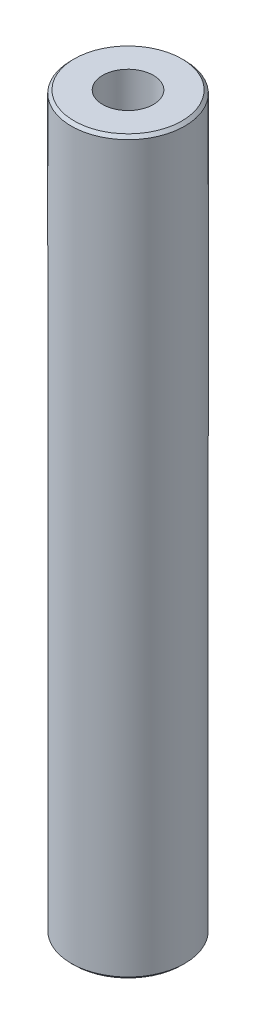
ISO-10303-21;
HEADER;
FILE_DESCRIPTION(('STEP AP214'),'2;1');
FILE_NAME('part.step','',(''),(''),'','','');
FILE_SCHEMA(('AUTOMOTIVE_DESIGN { 1 0 10303 214 1 1 1 1 }'));
ENDSEC;
DATA;
#1=APPLICATION_CONTEXT('core data for automotive mechanical design processes');
#2=APPLICATION_PROTOCOL_DEFINITION('international standard','automotive_design',2000,#1);
#3=PRODUCT_CONTEXT('',#1,'mechanical');
#4=PRODUCT('Part','Part','',(#3));
#5=PRODUCT_RELATED_PRODUCT_CATEGORY('part','',(#4));
#6=PRODUCT_DEFINITION_FORMATION('','',#4);
#7=PRODUCT_DEFINITION_CONTEXT('part definition',#1,'design');
#8=PRODUCT_DEFINITION('design','',#6,#7);
#9=PRODUCT_DEFINITION_SHAPE('','',#8);
#10=(LENGTH_UNIT() NAMED_UNIT(*) SI_UNIT(.MILLI.,.METRE.));
#11=(NAMED_UNIT(*) PLANE_ANGLE_UNIT() SI_UNIT($,.RADIAN.));
#12=(NAMED_UNIT(*) SI_UNIT($,.STERADIAN.) SOLID_ANGLE_UNIT());
#13=UNCERTAINTY_MEASURE_WITH_UNIT(LENGTH_MEASURE(1.E-05),#10,'distance_accuracy_value','');
#14=(GEOMETRIC_REPRESENTATION_CONTEXT(3) GLOBAL_UNCERTAINTY_ASSIGNED_CONTEXT((#13)) GLOBAL_UNIT_ASSIGNED_CONTEXT((#10,
#11,#12)) REPRESENTATION_CONTEXT('',''));
#15=CARTESIAN_POINT('',(0.,0.,0.));
#16=DIRECTION('',(0.,0.,1.));
#17=DIRECTION('',(1.,0.,0.));
#18=AXIS2_PLACEMENT_3D('',#15,#16,#17);
#19=CARTESIAN_POINT('',(0.,225.261387444064,0.));
#20=DIRECTION('',(0.,-1.,0.));
#21=DIRECTION('',(0.,0.,-1.));
#22=AXIS2_PLACEMENT_3D('',#19,#20,#21);
#23=CYLINDRICAL_SURFACE('',#22,17.5);
#24=CARTESIAN_POINT('',(0.,224.34722172086,0.));
#25=DIRECTION('',(0.,1.,0.));
#26=DIRECTION('',(0.,0.,1.));
#27=AXIS2_PLACEMENT_3D('',#24,#25,#26);
#28=CIRCLE('',#27,17.5);
#29=CARTESIAN_POINT('',(0.,224.34722172086,-17.5));
#30=VERTEX_POINT('',#29);
#31=EDGE_CURVE('E50',#30,#30,#28,.F.);
#32=CARTESIAN_POINT('',(0.,0.914165723204352,0.));
#33=DIRECTION('',(0.,1.,0.));
#34=DIRECTION('',(0.,0.,1.));
#35=AXIS2_PLACEMENT_3D('',#32,#33,#34);
#36=CIRCLE('',#35,17.5);
#37=CARTESIAN_POINT('',(0.,0.914165723204352,-17.5));
#38=VERTEX_POINT('',#37);
#39=EDGE_CURVE('E51',#38,#38,#36,.T.);
#40=CARTESIAN_POINT('',(0.,224.34722172086,-17.5));
#41=CARTESIAN_POINT('',(0.,222.019794054218,-17.5));
#42=CARTESIAN_POINT('',(0.,219.692366387575,-17.5));
#43=CARTESIAN_POINT('',(0.,215.037511054291,-17.5));
#44=CARTESIAN_POINT('',(0.,212.710083387649,-17.5));
#45=CARTESIAN_POINT('',(0.,208.055228054364,-17.5));
#46=CARTESIAN_POINT('',(0.,205.727800387722,-17.5));
#47=CARTESIAN_POINT('',(0.,201.072945054437,-17.5));
#48=CARTESIAN_POINT('',(0.,198.745517387795,-17.5));
#49=CARTESIAN_POINT('',(0.,194.090662054511,-17.5));
#50=CARTESIAN_POINT('',(0.,191.763234387868,-17.5));
#51=CARTESIAN_POINT('',(0.,187.108379054584,-17.5));
#52=CARTESIAN_POINT('',(0.,184.780951387942,-17.5));
#53=CARTESIAN_POINT('',(0.,180.126096054657,-17.5));
#54=CARTESIAN_POINT('',(0.,177.798668388015,-17.5));
#55=CARTESIAN_POINT('',(0.,173.14381305473,-17.5));
#56=CARTESIAN_POINT('',(0.,170.816385388088,-17.5));
#57=CARTESIAN_POINT('',(0.,166.161530054804,-17.5));
#58=CARTESIAN_POINT('',(0.,163.834102388161,-17.5));
#59=CARTESIAN_POINT('',(0.,159.179247054877,-17.5));
#60=CARTESIAN_POINT('',(0.,156.851819388235,-17.5));
#61=CARTESIAN_POINT('',(0.,152.19696405495,-17.5));
#62=CARTESIAN_POINT('',(0.,149.869536388308,-17.5));
#63=CARTESIAN_POINT('',(0.,145.214681055024,-17.5));
#64=CARTESIAN_POINT('',(0.,142.887253388381,-17.5));
#65=CARTESIAN_POINT('',(0.,138.232398055097,-17.5));
#66=CARTESIAN_POINT('',(0.,135.904970388455,-17.5));
#67=CARTESIAN_POINT('',(0.,131.25011505517,-17.5));
#68=CARTESIAN_POINT('',(0.,128.922687388528,-17.5));
#69=CARTESIAN_POINT('',(0.,124.267832055243,-17.5));
#70=CARTESIAN_POINT('',(0.,121.940404388601,-17.5));
#71=CARTESIAN_POINT('',(0.,117.285549055317,-17.5));
#72=CARTESIAN_POINT('',(0.,114.958121388674,-17.5));
#73=CARTESIAN_POINT('',(0.,110.30326605539,-17.5));
#74=CARTESIAN_POINT('',(0.,107.975838388748,-17.5));
#75=CARTESIAN_POINT('',(0.,103.320983055463,-17.5));
#76=CARTESIAN_POINT('',(0.,100.993555388821,-17.5));
#77=CARTESIAN_POINT('',(0.,96.3387000555364,-17.5));
#78=CARTESIAN_POINT('',(0.,94.0112723888942,-17.5));
#79=CARTESIAN_POINT('',(0.,89.3564170556097,-17.5));
#80=CARTESIAN_POINT('',(0.,87.0289893889674,-17.5));
#81=CARTESIAN_POINT('',(0.,82.3741340556829,-17.5));
#82=CARTESIAN_POINT('',(0.,80.0467063890407,-17.5));
#83=CARTESIAN_POINT('',(0.,75.3918510557562,-17.5));
#84=CARTESIAN_POINT('',(0.,73.0644233891139,-17.5));
#85=CARTESIAN_POINT('',(0.,68.4095680558294,-17.5));
#86=CARTESIAN_POINT('',(0.,66.0821403891872,-17.5));
#87=CARTESIAN_POINT('',(0.,61.4272850559027,-17.5));
#88=CARTESIAN_POINT('',(0.,59.0998573892605,-17.5));
#89=CARTESIAN_POINT('',(0.,54.445002055976,-17.5));
#90=CARTESIAN_POINT('',(0.,52.1175743893337,-17.5));
#91=CARTESIAN_POINT('',(0.,47.4627190560493,-17.5));
#92=CARTESIAN_POINT('',(0.,45.135291389407,-17.5));
#93=CARTESIAN_POINT('',(0.,40.4804360561225,-17.5));
#94=CARTESIAN_POINT('',(0.,38.1530083894803,-17.5));
#95=CARTESIAN_POINT('',(0.,33.4981530561958,-17.5));
#96=CARTESIAN_POINT('',(0.,31.1707253895535,-17.5));
#97=CARTESIAN_POINT('',(0.,26.515870056269,-17.5));
#98=CARTESIAN_POINT('',(0.,24.1884423896268,-17.5));
#99=CARTESIAN_POINT('',(0.,19.5335870563423,-17.5));
#100=CARTESIAN_POINT('',(0.,17.2061593897001,-17.5));
#101=CARTESIAN_POINT('',(0.,12.5513040564156,-17.5));
#102=CARTESIAN_POINT('',(0.,10.2238763897733,-17.5));
#103=CARTESIAN_POINT('',(0.,5.56902105648884,-17.5));
#104=CARTESIAN_POINT('',(0.,3.2415933898466,-17.5));
#105=CARTESIAN_POINT('',(0.,0.914165723204352,-17.5));
#106=B_SPLINE_CURVE_WITH_KNOTS('',3,(#40,#41,#42,#43,#44,#45,#46,#47,#48,#49,#50,#51,#52,#53,
#54,#55,#56,#57,#58,#59,#60,#61,#62,#63,#64,#65,#66,#67,#68,#69,#70,#71,#72,#73,#74,#75,#76,#77,
#78,#79,#80,#81,#82,#83,#84,#85,#86,#87,#88,#89,#90,#91,#92,#93,#94,#95,#96,#97,#98,#99,#100,
#101,#102,#103,#104,#105),.UNSPECIFIED.,.F.,.F.,(4,2,2,2,2,2,2,2,2,2,2,2,2,2,2,2,2,2,2,2,2,2,2,
2,2,2,2,2,2,2,2,2,4),(0.,6.98228299992673,13.9645659998535,20.9468489997802,27.9291319997069,
34.9114149996337,41.8936979995604,48.8759809994871,55.8582639994139,62.8405469993406,
69.8228299992673,76.805112999194,83.7873959991208,90.7696789990475,97.7519619989743,
104.734244998901,111.716527998828,118.698810998754,125.681093998681,132.663376998608,
139.645659998535,146.627942998461,153.610225998388,160.592508998315,167.574791998242,
174.557074998168,181.539357998095,188.521640998022,195.503923997949,202.486206997875,
209.468489997802,216.450772997729,223.433055997655),.UNSPECIFIED.);
#107=EDGE_CURVE('BSEAM39',#30,#38,#106,.T.);
#108=ORIENTED_EDGE('',*,*,#31,.T.);
#109=ORIENTED_EDGE('',*,*,#39,.T.);
#110=ORIENTED_EDGE('',*,*,#107,.T.);
#111=ORIENTED_EDGE('',*,*,#107,.F.);
#112=EDGE_LOOP('',(#108,#110,#109,#111));
#113=FACE_BOUND('',#112,.T.);
#114=ADVANCED_FACE('F39',(#113),#23,.T.);
#115=CARTESIAN_POINT('',(0.,225.261387444064,0.));
#116=DIRECTION('',(0.,1.,0.));
#117=DIRECTION('',(0.,0.,1.));
#118=AXIS2_PLACEMENT_3D('',#115,#116,#117);
#119=PLANE('',#118);
#120=CARTESIAN_POINT('',(0.,225.261387444064,0.));
#121=DIRECTION('',(0.,1.,0.));
#122=DIRECTION('',(0.,0.,1.));
#123=AXIS2_PLACEMENT_3D('',#120,#121,#122);
#124=CIRCLE('',#123,16.5858342767959);
#125=CARTESIAN_POINT('',(0.,225.261387444064,-16.5858342767959));
#126=VERTEX_POINT('',#125);
#127=EDGE_CURVE('E54',#126,#126,#124,.T.);
#128=ORIENTED_EDGE('',*,*,#127,.T.);
#129=EDGE_LOOP('',(#128));
#130=FACE_BOUND('',#129,.T.);
#131=CARTESIAN_POINT('',(0.,225.261387444064,0.));
#132=DIRECTION('',(0.,1.,0.));
#133=DIRECTION('',(0.,0.,1.));
#134=AXIS2_PLACEMENT_3D('',#131,#132,#133);
#135=CIRCLE('',#134,7.81030268506756);
#136=CARTESIAN_POINT('',(0.,225.261387444064,-7.81030268506756));
#137=VERTEX_POINT('',#136);
#138=EDGE_CURVE('E58',#137,#137,#135,.T.);
#139=ORIENTED_EDGE('',*,*,#138,.F.);
#140=EDGE_LOOP('',(#139));
#141=FACE_BOUND('',#140,.T.);
#142=ADVANCED_FACE('F69',(#130,#141),#119,.T.);
#143=CARTESIAN_POINT('',(0.,0.,0.));
#144=DIRECTION('',(0.,1.,0.));
#145=DIRECTION('',(0.,0.,1.));
#146=AXIS2_PLACEMENT_3D('',#143,#144,#145);
#147=PLANE('',#146);
#148=CARTESIAN_POINT('',(0.,0.,0.));
#149=DIRECTION('',(0.,1.,0.));
#150=DIRECTION('',(0.,0.,1.));
#151=AXIS2_PLACEMENT_3D('',#148,#149,#150);
#152=CIRCLE('',#151,16.5858342767957);
#153=CARTESIAN_POINT('',(0.,0.,16.5858342767957));
#154=VERTEX_POINT('',#153);
#155=EDGE_CURVE('E10',#154,#154,#152,.F.);
#156=ORIENTED_EDGE('',*,*,#155,.T.);
#157=EDGE_LOOP('',(#156));
#158=FACE_BOUND('',#157,.T.);
#159=CARTESIAN_POINT('',(0.,0.,0.));
#160=DIRECTION('',(0.,1.,0.));
#161=DIRECTION('',(0.,0.,1.));
#162=AXIS2_PLACEMENT_3D('',#159,#160,#161);
#163=CIRCLE('',#162,7.81030268506756);
#164=CARTESIAN_POINT('',(0.,0.,-7.81030268506756));
#165=VERTEX_POINT('',#164);
#166=EDGE_CURVE('E63',#165,#165,#163,.T.);
#167=ORIENTED_EDGE('',*,*,#166,.T.);
#168=EDGE_LOOP('',(#167));
#169=FACE_BOUND('',#168,.T.);
#170=ADVANCED_FACE('F75',(#158,#169),#147,.F.);
#171=CARTESIAN_POINT('',(0.,225.261387444064,0.));
#172=DIRECTION('',(0.,-1.,0.));
#173=DIRECTION('',(0.,0.,-1.));
#174=AXIS2_PLACEMENT_3D('',#171,#172,#173);
#175=CYLINDRICAL_SURFACE('',#174,7.81030268506756);
#176=CARTESIAN_POINT('',(0.,225.261387444064,-7.81030268506756));
#177=CARTESIAN_POINT('',(0.,222.914914658188,-7.81030268506756));
#178=CARTESIAN_POINT('',(0.,220.568441872313,-7.81030268506756));
#179=CARTESIAN_POINT('',(0.,215.875496300561,-7.81030268506756));
#180=CARTESIAN_POINT('',(0.,213.529023514686,-7.81030268506756));
#181=CARTESIAN_POINT('',(0.,208.836077942934,-7.81030268506756));
#182=CARTESIAN_POINT('',(0.,206.489605157059,-7.81030268506756));
#183=CARTESIAN_POINT('',(0.,201.796659585307,-7.81030268506756));
#184=CARTESIAN_POINT('',(0.,199.450186799432,-7.81030268506756));
#185=CARTESIAN_POINT('',(0.,194.75724122768,-7.81030268506756));
#186=CARTESIAN_POINT('',(0.,192.410768441805,-7.81030268506756));
#187=CARTESIAN_POINT('',(0.,187.717822870053,-7.81030268506756));
#188=CARTESIAN_POINT('',(0.,185.371350084178,-7.81030268506756));
#189=CARTESIAN_POINT('',(0.,180.678404512426,-7.81030268506756));
#190=CARTESIAN_POINT('',(0.,178.331931726551,-7.81030268506756));
#191=CARTESIAN_POINT('',(0.,173.638986154799,-7.81030268506756));
#192=CARTESIAN_POINT('',(0.,171.292513368924,-7.81030268506756));
#193=CARTESIAN_POINT('',(0.,166.599567797172,-7.81030268506756));
#194=CARTESIAN_POINT('',(0.,164.253095011297,-7.81030268506756));
#195=CARTESIAN_POINT('',(0.,159.560149439545,-7.81030268506756));
#196=CARTESIAN_POINT('',(0.,157.21367665367,-7.81030268506756));
#197=CARTESIAN_POINT('',(0.,152.520731081918,-7.81030268506756));
#198=CARTESIAN_POINT('',(0.,150.174258296043,-7.81030268506756));
#199=CARTESIAN_POINT('',(0.,145.481312724291,-7.81030268506756));
#200=CARTESIAN_POINT('',(0.,143.134839938416,-7.81030268506756));
#201=CARTESIAN_POINT('',(0.,138.441894366664,-7.81030268506756));
#202=CARTESIAN_POINT('',(0.,136.095421580789,-7.81030268506756));
#203=CARTESIAN_POINT('',(0.,131.402476009037,-7.81030268506756));
#204=CARTESIAN_POINT('',(0.,129.056003223162,-7.81030268506756));
#205=CARTESIAN_POINT('',(0.,124.36305765141,-7.81030268506756));
#206=CARTESIAN_POINT('',(0.,122.016584865535,-7.81030268506756));
#207=CARTESIAN_POINT('',(0.,117.323639293783,-7.81030268506756));
#208=CARTESIAN_POINT('',(0.,114.977166507908,-7.81030268506756));
#209=CARTESIAN_POINT('',(0.,110.284220936156,-7.81030268506756));
#210=CARTESIAN_POINT('',(0.,107.937748150281,-7.81030268506756));
#211=CARTESIAN_POINT('',(0.,103.244802578529,-7.81030268506756));
#212=CARTESIAN_POINT('',(0.,100.898329792654,-7.81030268506756));
#213=CARTESIAN_POINT('',(0.,96.2053842209023,-7.81030268506756));
#214=CARTESIAN_POINT('',(0.,93.8589114350267,-7.81030268506756));
#215=CARTESIAN_POINT('',(0.,89.1659658632753,-7.81030268506756));
#216=CARTESIAN_POINT('',(0.,86.8194930773997,-7.81030268506756));
#217=CARTESIAN_POINT('',(0.,82.1265475056483,-7.81030268506756));
#218=CARTESIAN_POINT('',(0.,79.7800747197727,-7.81030268506756));
#219=CARTESIAN_POINT('',(0.,75.0871291480213,-7.81030268506756));
#220=CARTESIAN_POINT('',(0.,72.7406563621456,-7.81030268506756));
#221=CARTESIAN_POINT('',(0.,68.0477107903943,-7.81030268506756));
#222=CARTESIAN_POINT('',(0.,65.7012380045187,-7.81030268506756));
#223=CARTESIAN_POINT('',(0.,61.0082924327673,-7.81030268506756));
#224=CARTESIAN_POINT('',(0.,58.6618196468917,-7.81030268506756));
#225=CARTESIAN_POINT('',(0.,53.9688740751403,-7.81030268506756));
#226=CARTESIAN_POINT('',(0.,51.6224012892647,-7.81030268506756));
#227=CARTESIAN_POINT('',(0.,46.9294557175133,-7.81030268506756));
#228=CARTESIAN_POINT('',(0.,44.5829829316377,-7.81030268506756));
#229=CARTESIAN_POINT('',(0.,39.8900373598863,-7.81030268506756));
#230=CARTESIAN_POINT('',(0.,37.5435645740107,-7.81030268506756));
#231=CARTESIAN_POINT('',(0.,32.8506190022593,-7.81030268506756));
#232=CARTESIAN_POINT('',(0.,30.5041462163837,-7.81030268506756));
#233=CARTESIAN_POINT('',(0.,25.8112006446323,-7.81030268506756));
#234=CARTESIAN_POINT('',(0.,23.4647278587567,-7.81030268506756));
#235=CARTESIAN_POINT('',(0.,18.7717822870053,-7.81030268506756));
#236=CARTESIAN_POINT('',(0.,16.4253095011297,-7.81030268506756));
#237=CARTESIAN_POINT('',(0.,11.7323639293783,-7.81030268506756));
#238=CARTESIAN_POINT('',(0.,9.38589114350267,-7.81030268506756));
#239=CARTESIAN_POINT('',(0.,4.69294557175133,-7.81030268506756));
#240=CARTESIAN_POINT('',(0.,2.34647278587566,-7.81030268506756));
#241=CARTESIAN_POINT('',(0.,0.,-7.81030268506756));
#242=B_SPLINE_CURVE_WITH_KNOTS('',3,(#176,#177,#178,#179,#180,#181,#182,#183,#184,#185,#186,
#187,#188,#189,#190,#191,#192,#193,#194,#195,#196,#197,#198,#199,#200,#201,#202,#203,#204,#205,
#206,#207,#208,#209,#210,#211,#212,#213,#214,#215,#216,#217,#218,#219,#220,#221,#222,#223,#224,
#225,#226,#227,#228,#229,#230,#231,#232,#233,#234,#235,#236,#237,#238,#239,#240,#241),
.UNSPECIFIED.,.F.,.F.,(4,2,2,2,2,2,2,2,2,2,2,2,2,2,2,2,2,2,2,2,2,2,2,2,2,2,2,2,2,2,2,2,4),(0.,
7.03941835762698,14.078836715254,21.118255072881,28.157673430508,35.197091788135,
42.236510145762,49.275928503389,56.315346861016,63.354765218643,70.39418357627,77.433601933897,
84.473020291524,91.512438649151,98.551857006778,105.591275364405,112.630693722032,
119.670112079659,126.709530437286,133.748948794913,140.78836715254,147.827785510167,
154.867203867794,161.906622225421,168.946040583048,175.985458940675,183.024877298302,
190.064295655929,197.103714013556,204.143132371183,211.18255072881,218.221969086437,
225.261387444064),.UNSPECIFIED.);
#243=EDGE_CURVE('BSEAM70',#137,#165,#242,.T.);
#244=ORIENTED_EDGE('',*,*,#138,.T.);
#245=ORIENTED_EDGE('',*,*,#166,.F.);
#246=ORIENTED_EDGE('',*,*,#243,.T.);
#247=ORIENTED_EDGE('',*,*,#243,.F.);
#248=EDGE_LOOP('',(#244,#246,#245,#247));
#249=FACE_BOUND('',#248,.T.);
#250=ADVANCED_FACE('F70',(#249),#175,.F.);
#251=CARTESIAN_POINT('',(0.,225.261387444064,0.));
#252=DIRECTION('',(0.,-1.,0.));
#253=DIRECTION('',(0.,0.,-1.));
#254=AXIS2_PLACEMENT_3D('',#251,#252,#253);
#255=CONICAL_SURFACE('',#254,16.5858342767959,0.785398163397475);
#256=CARTESIAN_POINT('',(0.,224.34722172086,-17.5));
#257=CARTESIAN_POINT('',(0.,224.356744280477,-17.4904774403833));
#258=CARTESIAN_POINT('',(0.,224.366266840093,-17.4809548807666));
#259=CARTESIAN_POINT('',(0.,224.385311959327,-17.4619097615332));
#260=CARTESIAN_POINT('',(0.,224.394834518943,-17.4523872019165));
#261=CARTESIAN_POINT('',(0.,224.413879638177,-17.433342082683));
#262=CARTESIAN_POINT('',(0.,224.423402197794,-17.4238195230663));
#263=CARTESIAN_POINT('',(0.,224.442447317027,-17.4047744038329));
#264=CARTESIAN_POINT('',(0.,224.451969876644,-17.3952518442162));
#265=CARTESIAN_POINT('',(0.,224.471014995877,-17.3762067249828));
#266=CARTESIAN_POINT('',(0.,224.480537555494,-17.3666841653661));
#267=CARTESIAN_POINT('',(0.,224.499582674727,-17.3476390461327));
#268=CARTESIAN_POINT('',(0.,224.509105234344,-17.338116486516));
#269=CARTESIAN_POINT('',(0.,224.528150353577,-17.3190713672825));
#270=CARTESIAN_POINT('',(0.,224.537672913194,-17.3095488076658));
#271=CARTESIAN_POINT('',(0.,224.556718032427,-17.2905036884324));
#272=CARTESIAN_POINT('',(0.,224.566240592044,-17.2809811288157));
#273=CARTESIAN_POINT('',(0.,224.585285711278,-17.2619360095823));
#274=CARTESIAN_POINT('',(0.,224.594808270894,-17.2524134499656));
#275=CARTESIAN_POINT('',(0.,224.613853390128,-17.2333683307321));
#276=CARTESIAN_POINT('',(0.,224.623375949744,-17.2238457711154));
#277=CARTESIAN_POINT('',(0.,224.642421068978,-17.204800651882));
#278=CARTESIAN_POINT('',(0.,224.651943628595,-17.1952780922653));
#279=CARTESIAN_POINT('',(0.,224.670988747828,-17.1762329730319));
#280=CARTESIAN_POINT('',(0.,224.680511307445,-17.1667104134152));
#281=CARTESIAN_POINT('',(0.,224.699556426678,-17.1476652941818));
#282=CARTESIAN_POINT('',(0.,224.709078986295,-17.138142734565));
#283=CARTESIAN_POINT('',(0.,224.728124105528,-17.1190976153316));
#284=CARTESIAN_POINT('',(0.,224.737646665145,-17.1095750557149));
#285=CARTESIAN_POINT('',(0.,224.756691784378,-17.0905299364815));
#286=CARTESIAN_POINT('',(0.,224.766214343995,-17.0810073768648));
#287=CARTESIAN_POINT('',(0.,224.785259463228,-17.0619622576314));
#288=CARTESIAN_POINT('',(0.,224.794782022845,-17.0524396980147));
#289=CARTESIAN_POINT('',(0.,224.813827142079,-17.0333945787812));
#290=CARTESIAN_POINT('',(0.,224.823349701695,-17.0238720191645));
#291=CARTESIAN_POINT('',(0.,224.842394820929,-17.0048268999311));
#292=CARTESIAN_POINT('',(0.,224.851917380545,-16.9953043403144));
#293=CARTESIAN_POINT('',(0.,224.870962499779,-16.976259221081));
#294=CARTESIAN_POINT('',(0.,224.880485059396,-16.9667366614643));
#295=CARTESIAN_POINT('',(0.,224.899530178629,-16.9476915422308));
#296=CARTESIAN_POINT('',(0.,224.909052738246,-16.9381689826141));
#297=CARTESIAN_POINT('',(0.,224.928097857479,-16.9191238633807));
#298=CARTESIAN_POINT('',(0.,224.937620417096,-16.909601303764));
#299=CARTESIAN_POINT('',(0.,224.956665536329,-16.8905561845306));
#300=CARTESIAN_POINT('',(0.,224.966188095946,-16.8810336249139));
#301=CARTESIAN_POINT('',(0.,224.985233215179,-16.8619885056805));
#302=CARTESIAN_POINT('',(0.,224.994755774796,-16.8524659460637));
#303=CARTESIAN_POINT('',(0.,225.01380089403,-16.8334208268303));
#304=CARTESIAN_POINT('',(0.,225.023323453646,-16.8238982672136));
#305=CARTESIAN_POINT('',(0.,225.04236857288,-16.8048531479802));
#306=CARTESIAN_POINT('',(0.,225.051891132496,-16.7953305883635));
#307=CARTESIAN_POINT('',(0.,225.07093625173,-16.7762854691301));
#308=CARTESIAN_POINT('',(0.,225.080458811346,-16.7667629095134));
#309=CARTESIAN_POINT('',(0.,225.09950393058,-16.7477177902799));
#310=CARTESIAN_POINT('',(0.,225.109026490197,-16.7381952306632));
#311=CARTESIAN_POINT('',(0.,225.12807160943,-16.7191501114298));
#312=CARTESIAN_POINT('',(0.,225.137594169047,-16.7096275518131));
#313=CARTESIAN_POINT('',(0.,225.15663928828,-16.6905824325797));
#314=CARTESIAN_POINT('',(0.,225.166161847897,-16.681059872963));
#315=CARTESIAN_POINT('',(0.,225.18520696713,-16.6620147537295));
#316=CARTESIAN_POINT('',(0.,225.194729526747,-16.6524921941128));
#317=CARTESIAN_POINT('',(0.,225.21377464598,-16.6334470748794));
#318=CARTESIAN_POINT('',(0.,225.223297205597,-16.6239245152627));
#319=CARTESIAN_POINT('',(0.,225.242342324831,-16.6048793960293));
#320=CARTESIAN_POINT('',(0.,225.251864884447,-16.5953568364126));
#321=CARTESIAN_POINT('',(0.,225.261387444064,-16.5858342767959));
#322=B_SPLINE_CURVE_WITH_KNOTS('',3,(#256,#257,#258,#259,#260,#261,#262,#263,#264,#265,#266,
#267,#268,#269,#270,#271,#272,#273,#274,#275,#276,#277,#278,#279,#280,#281,#282,#283,#284,#285,
#286,#287,#288,#289,#290,#291,#292,#293,#294,#295,#296,#297,#298,#299,#300,#301,#302,#303,#304,
#305,#306,#307,#308,#309,#310,#311,#312,#313,#314,#315,#316,#317,#318,#319,#320,#321),
.UNSPECIFIED.,.F.,.F.,(4,2,2,2,2,2,2,2,2,2,2,2,2,2,2,2,2,2,2,2,2,2,2,2,2,2,2,2,2,2,2,2,4),(0.,
0.0404007988753863,0.0808015977507529,0.121202396626122,0.161603195501489,0.202003994376875,
0.242404793252242,0.282805592127608,0.323206391002975,0.363607189878344,0.40400798875373,
0.444408787629097,0.484809586504463,0.52521038537983,0.565611184255219,0.606011983130585,
0.646412782005952,0.686813580881319,0.727214379756686,0.767615178632074,0.808015977507441,
0.848416776382808,0.888817575258174,0.929218374133561,0.96961917300893,1.0100199718843,
1.05042077075966,1.09082156963503,1.13122236851042,1.17162316738578,1.21202396626115,
1.25242476513652,1.2928255640119),.UNSPECIFIED.);
#323=EDGE_CURVE('BSEAM81',#30,#126,#322,.T.);
#324=ORIENTED_EDGE('',*,*,#31,.F.);
#325=ORIENTED_EDGE('',*,*,#127,.F.);
#326=ORIENTED_EDGE('',*,*,#323,.T.);
#327=ORIENTED_EDGE('',*,*,#323,.F.);
#328=EDGE_LOOP('',(#324,#326,#325,#327));
#329=FACE_BOUND('',#328,.T.);
#330=ADVANCED_FACE('F81',(#329),#255,.T.);
#331=CARTESIAN_POINT('',(0.,0.914165723204352,0.));
#332=DIRECTION('',(0.,1.,0.));
#333=DIRECTION('',(0.,0.,1.));
#334=AXIS2_PLACEMENT_3D('',#331,#332,#333);
#335=CONICAL_SURFACE('',#334,17.5,0.785398163397445);
#336=ORIENTED_EDGE('',*,*,#155,.F.);
#337=EDGE_LOOP('',(#336));
#338=FACE_BOUND('',#337,.T.);
#339=ORIENTED_EDGE('',*,*,#39,.F.);
#340=EDGE_LOOP('',(#339));
#341=FACE_BOUND('',#340,.T.);
#342=ADVANCED_FACE('F45',(#338,#341),#335,.T.);
#343=CLOSED_SHELL('',(#114,#142,#170,#250,#330,#342));
#344=MANIFOLD_SOLID_BREP('B2',#343);
#345=ADVANCED_BREP_SHAPE_REPRESENTATION('',(#18,#344),#14);
#346=SHAPE_DEFINITION_REPRESENTATION(#9,#345);
ENDSEC;
END-ISO-10303-21;
